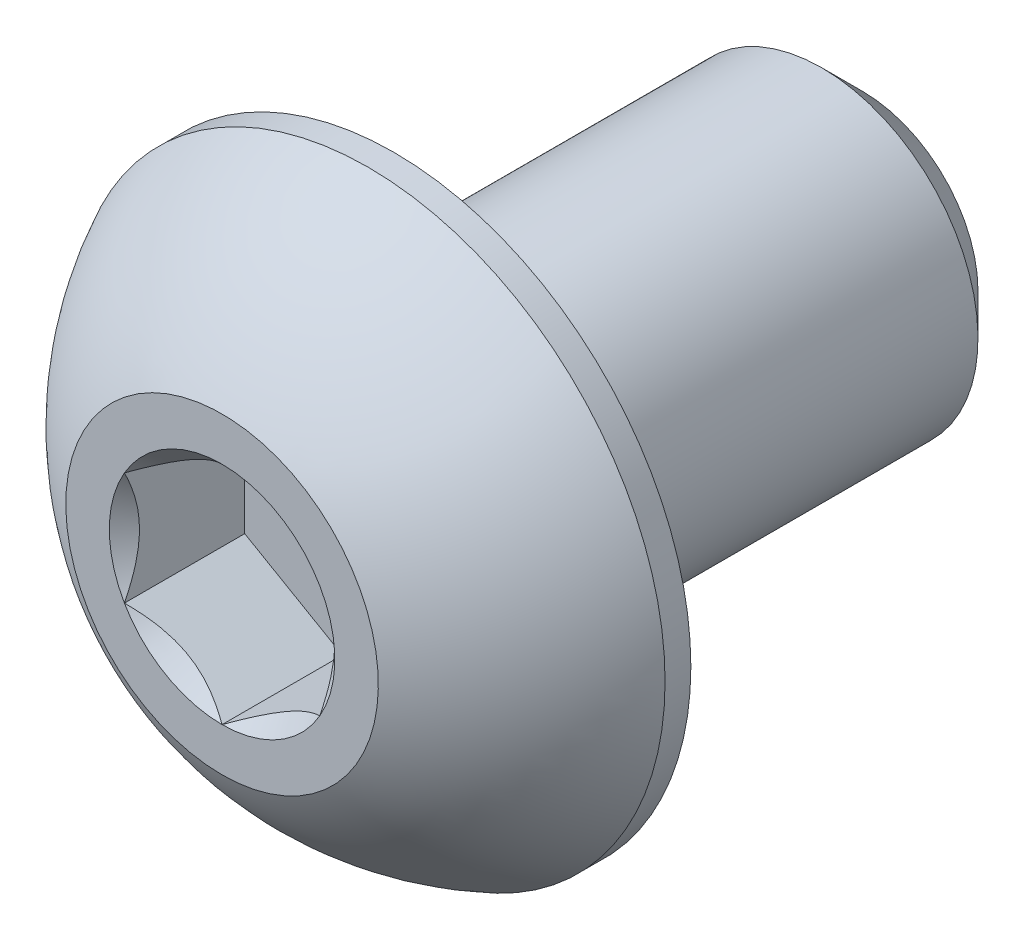
ISO-10303-21;
HEADER;
FILE_DESCRIPTION(('STEP AP214'),'2;1');
FILE_NAME('part.step','',(''),(''),'','','');
FILE_SCHEMA(('AUTOMOTIVE_DESIGN { 1 0 10303 214 1 1 1 1 }'));
ENDSEC;
DATA;
#1=APPLICATION_CONTEXT('core data for automotive mechanical design processes');
#2=APPLICATION_PROTOCOL_DEFINITION('international standard','automotive_design',2000,#1);
#3=PRODUCT_CONTEXT('',#1,'mechanical');
#4=PRODUCT('Part','Part','',(#3));
#5=PRODUCT_RELATED_PRODUCT_CATEGORY('part','',(#4));
#6=PRODUCT_DEFINITION_FORMATION('','',#4);
#7=PRODUCT_DEFINITION_CONTEXT('part definition',#1,'design');
#8=PRODUCT_DEFINITION('design','',#6,#7);
#9=PRODUCT_DEFINITION_SHAPE('','',#8);
#10=(LENGTH_UNIT() NAMED_UNIT(*) SI_UNIT(.MILLI.,.METRE.));
#11=(NAMED_UNIT(*) PLANE_ANGLE_UNIT() SI_UNIT($,.RADIAN.));
#12=(NAMED_UNIT(*) SI_UNIT($,.STERADIAN.) SOLID_ANGLE_UNIT());
#13=UNCERTAINTY_MEASURE_WITH_UNIT(LENGTH_MEASURE(1.E-05),#10,'distance_accuracy_value','');
#14=(GEOMETRIC_REPRESENTATION_CONTEXT(3) GLOBAL_UNCERTAINTY_ASSIGNED_CONTEXT((#13)) GLOBAL_UNIT_ASSIGNED_CONTEXT((#10,
#11,#12)) REPRESENTATION_CONTEXT('',''));
#15=CARTESIAN_POINT('',(0.,0.,0.));
#16=DIRECTION('',(0.,0.,1.));
#17=DIRECTION('',(1.,0.,0.));
#18=AXIS2_PLACEMENT_3D('',#15,#16,#17);
#19=CARTESIAN_POINT('',(0.,-2.00000000000001,-8.2));
#20=DIRECTION('',(0.,0.,-1.));
#21=DIRECTION('',(0.,1.,0.));
#22=AXIS2_PLACEMENT_3D('',#19,#20,#21);
#23=PLANE('',#22);
#24=CARTESIAN_POINT('',(0.,0.,-8.2));
#25=DIRECTION('',(0.,0.,-1.));
#26=DIRECTION('',(0.,1.,0.));
#27=AXIS2_PLACEMENT_3D('',#24,#25,#26);
#28=CIRCLE('',#27,1.475);
#29=CARTESIAN_POINT('',(0.,1.475,-8.2));
#30=VERTEX_POINT('',#29);
#31=EDGE_CURVE('E174',#30,#30,#28,.T.);
#32=ORIENTED_EDGE('',*,*,#31,.T.);
#33=EDGE_LOOP('',(#32));
#34=FACE_BOUND('',#33,.T.);
#35=ADVANCED_FACE('F35',(#34),#23,.T.);
#36=CARTESIAN_POINT('',(0.,0.,-8.2));
#37=DIRECTION('',(0.,0.,-1.));
#38=DIRECTION('',(0.,1.,0.));
#39=AXIS2_PLACEMENT_3D('',#36,#37,#38);
#40=CYLINDRICAL_SURFACE('',#39,2.);
#41=CARTESIAN_POINT('',(0.,0.,-7.675));
#42=DIRECTION('',(0.,0.,-1.));
#43=DIRECTION('',(0.,1.,0.));
#44=AXIS2_PLACEMENT_3D('',#41,#42,#43);
#45=CIRCLE('',#44,2.);
#46=CARTESIAN_POINT('',(0.,2.,-7.675));
#47=VERTEX_POINT('',#46);
#48=EDGE_CURVE('E48',#47,#47,#45,.F.);
#49=ORIENTED_EDGE('',*,*,#48,.T.);
#50=EDGE_LOOP('',(#49));
#51=FACE_BOUND('',#50,.T.);
#52=CARTESIAN_POINT('',(0.,0.,-2.2));
#53=DIRECTION('',(0.,0.,1.));
#54=DIRECTION('',(1.,0.,0.));
#55=AXIS2_PLACEMENT_3D('',#52,#53,#54);
#56=CIRCLE('',#55,2.);
#57=CARTESIAN_POINT('',(2.,0.,-2.2));
#58=VERTEX_POINT('',#57);
#59=EDGE_CURVE('E171',#58,#58,#56,.F.);
#60=ORIENTED_EDGE('',*,*,#59,.T.);
#61=EDGE_LOOP('',(#60));
#62=FACE_BOUND('',#61,.T.);
#63=ADVANCED_FACE('F179',(#51,#62),#40,.T.);
#64=CARTESIAN_POINT('',(0.,0.,-8.2));
#65=DIRECTION('',(0.,0.,1.));
#66=DIRECTION('',(0.,-1.,0.));
#67=AXIS2_PLACEMENT_3D('',#64,#65,#66);
#68=CONICAL_SURFACE('',#67,1.47500000000001,0.785398163397446);
#69=ORIENTED_EDGE('',*,*,#48,.F.);
#70=EDGE_LOOP('',(#69));
#71=FACE_BOUND('',#70,.T.);
#72=ORIENTED_EDGE('',*,*,#31,.F.);
#73=EDGE_LOOP('',(#72));
#74=FACE_BOUND('',#73,.T.);
#75=ADVANCED_FACE('F37',(#71,#74),#68,.T.);
#76=CARTESIAN_POINT('',(0.,0.,-3.72644385026738));
#77=DIRECTION('',(0.,0.,1.));
#78=DIRECTION('',(0.,-1.,0.));
#79=AXIS2_PLACEMENT_3D('',#76,#77,#78);
#80=SPHERICAL_SURFACE('',#79,4.22922968981298);
#81=CARTESIAN_POINT('',(0.,0.,0.));
#82=DIRECTION('',(0.,0.,1.));
#83=DIRECTION('',(1.,0.,0.));
#84=AXIS2_PLACEMENT_3D('',#81,#82,#83);
#85=CIRCLE('',#84,2.);
#86=CARTESIAN_POINT('',(0.,-2.,0.));
#87=VERTEX_POINT('',#86);
#88=EDGE_CURVE('E168',#87,#87,#85,.T.);
#89=CARTESIAN_POINT('',(0.,0.,-1.87));
#90=DIRECTION('',(0.,0.,1.));
#91=DIRECTION('',(1.,0.,0.));
#92=AXIS2_PLACEMENT_3D('',#89,#90,#91);
#93=CIRCLE('',#92,3.8);
#94=CARTESIAN_POINT('',(0.,-3.8,-1.87));
#95=VERTEX_POINT('',#94);
#96=EDGE_CURVE('E162',#95,#95,#93,.T.);
#97=CARTESIAN_POINT('',(0.,-2.,0.));
#98=CARTESIAN_POINT('',(0.,-2.02421343985614,-0.0129954259644873));
#99=CARTESIAN_POINT('',(0.,-2.04830018323974,-0.0262269129651302));
#100=CARTESIAN_POINT('',(0.,-2.09621120342126,-0.0531568415057495));
#101=CARTESIAN_POINT('',(0.,-2.12003548021917,-0.066855283045726));
#102=CARTESIAN_POINT('',(0.,-2.16741249358867,-0.0947139531320321));
#103=CARTESIAN_POINT('',(0.,-2.19096523016026,-0.108874181678362));
#104=CARTESIAN_POINT('',(0.,-2.23779021933683,-0.137651035235957));
#105=CARTESIAN_POINT('',(0.,-2.26106247194181,-0.152267660247222));
#106=CARTESIAN_POINT('',(0.,-2.30731764886072,-0.181951755514141));
#107=CARTESIAN_POINT('',(0.,-2.33030057317465,-0.197019225769796));
#108=CARTESIAN_POINT('',(0.,-2.37596836104235,-0.227599285582871));
#109=CARTESIAN_POINT('',(0.,-2.39865322459612,-0.243111875140292));
#110=CARTESIAN_POINT('',(0.,-2.44371627121513,-0.274576279395883));
#111=CARTESIAN_POINT('',(0.,-2.46609445428038,-0.290528094094053));
#112=CARTESIAN_POINT('',(0.,-2.51053563686181,-0.322864887331672));
#113=CARTESIAN_POINT('',(0.,-2.53259863637801,-0.339249865871121));
#114=CARTESIAN_POINT('',(0.,-2.57640106852492,-0.372446760967231));
#115=CARTESIAN_POINT('',(0.,-2.59814050115564,-0.389258677523893));
#116=CARTESIAN_POINT('',(0.,-2.64128753915154,-0.423303060588148));
#117=CARTESIAN_POINT('',(0.,-2.66269514451671,-0.440535527095743));
#118=CARTESIAN_POINT('',(0.,-2.70517039368395,-0.475414462202967));
#119=CARTESIAN_POINT('',(0.,-2.72623803748602,-0.493060930802598));
#120=CARTESIAN_POINT('',(0.,-2.76802535840619,-0.528761164924409));
#121=CARTESIAN_POINT('',(0.,-2.78874503552428,-0.54681493044659));
#122=CARTESIAN_POINT('',(0.,-2.82982855017313,-0.583322898482807));
#123=CARTESIAN_POINT('',(0.,-2.85019238770389,-0.601777100996844));
#124=CARTESIAN_POINT('',(0.,-2.89055648548394,-0.639078930931023));
#125=CARTESIAN_POINT('',(0.,-2.91055674573324,-0.657926558351166));
#126=CARTESIAN_POINT('',(0.,-2.95018608940553,-0.696008076521266));
#127=CARTESIAN_POINT('',(0.,-2.96981517282852,-0.715241967271224));
#128=CARTESIAN_POINT('',(0.,-3.00869470434027,-0.754088703755294));
#129=CARTESIAN_POINT('',(0.,-3.02794515242903,-0.773701549489406));
#130=CARTESIAN_POINT('',(0.,-3.06606009863533,-0.813298743603726));
#131=CARTESIAN_POINT('',(0.,-3.08492459675287,-0.833283091983934));
#132=CARTESIAN_POINT('',(0.,-3.12226047503003,-0.873615697891678));
#133=CARTESIAN_POINT('',(0.,-3.14073185518965,-0.893963955419212));
#134=CARTESIAN_POINT('',(0.,-3.17727447893821,-0.935016647847443));
#135=CARTESIAN_POINT('',(0.,-3.19534572252716,-0.955721082748139));
#136=CARTESIAN_POINT('',(0.,-3.23108120656242,-0.997478262810989));
#137=CARTESIAN_POINT('',(0.,-3.24874544700875,-1.01853100797314));
#138=CARTESIAN_POINT('',(0.,-3.28366021283673,-1.06097680909897));
#139=CARTESIAN_POINT('',(0.,-3.30091073821839,-1.08236986506264));
#140=CARTESIAN_POINT('',(0.,-3.33499151919534,-1.12548815902283));
#141=CARTESIAN_POINT('',(0.,-3.35182177479064,-1.14721339701936));
#142=CARTESIAN_POINT('',(0.,-3.38505562116371,-1.1909878000568));
#143=CARTESIAN_POINT('',(0.,-3.40145921194149,-1.21303696509771));
#144=CARTESIAN_POINT('',(0.,-3.43383349577047,-1.25745084415152));
#145=CARTESIAN_POINT('',(0.,-3.44980418882166,-1.27981555816441));
#146=CARTESIAN_POINT('',(0.,-3.48130660877275,-1.32485203719233));
#147=CARTESIAN_POINT('',(0.,-3.49683833567264,-1.34752380220736));
#148=CARTESIAN_POINT('',(0.,-3.52745692170931,-1.39316576858967));
#149=CARTESIAN_POINT('',(0.,-3.5425437808461,-1.41613596995694));
#150=CARTESIAN_POINT('',(0.,-3.57226689871518,-1.46236608103065));
#151=CARTESIAN_POINT('',(0.,-3.58690315744748,-1.48562599073709));
#152=CARTESIAN_POINT('',(0.,-3.61571951333199,-1.5324266802666));
#153=CARTESIAN_POINT('',(0.,-3.62989961048422,-1.55596746008967));
#154=CARTESIAN_POINT('',(0.,-3.65779825442823,-1.6033209453859));
#155=CARTESIAN_POINT('',(0.,-3.67151680122002,-1.62713365085906));
#156=CARTESIAN_POINT('',(0.,-3.69848713452321,-1.67502193787766));
#157=CARTESIAN_POINT('',(0.,-3.71173892103461,-1.6990975194231));
#158=CARTESIAN_POINT('',(0.,-3.73777068821038,-1.74750241579215));
#159=CARTESIAN_POINT('',(0.,-3.75055066887474,-1.77183173061575));
#160=CARTESIAN_POINT('',(0.,-3.77563400658953,-1.82073482944519));
#161=CARTESIAN_POINT('',(0.,-3.78793736363997,-1.84530861345103));
#162=CARTESIAN_POINT('',(0.,-3.8,-1.87));
#163=B_SPLINE_CURVE_WITH_KNOTS('',3,(#97,#98,#99,#100,#101,#102,#103,#104,#105,#106,#107,#108,
#109,#110,#111,#112,#113,#114,#115,#116,#117,#118,#119,#120,#121,#122,#123,#124,#125,#126,#127,
#128,#129,#130,#131,#132,#133,#134,#135,#136,#137,#138,#139,#140,#141,#142,#143,#144,#145,#146,
#147,#148,#149,#150,#151,#152,#153,#154,#155,#156,#157,#158,#159,#160,#161,#162),.UNSPECIFIED.,
.F.,.F.,(4,2,2,2,2,2,2,2,2,2,2,2,2,2,2,2,2,2,2,2,2,2,2,2,2,2,2,2,2,2,2,2,4),(0.,
0.082439858910264,0.164879717820529,0.247319576730793,0.329759435641058,0.412199294551322,
0.494639153461585,0.57707901237185,0.659518871282114,0.741958730192379,0.824398589102643,
0.906838448012907,0.989278306923171,1.07171816583344,1.1541580247437,1.23659788365396,
1.31903774256423,1.40147760147449,1.48391746038476,1.56635731929502,1.64879717820529,
1.73123703711555,1.81367689602581,1.89611675493608,1.97855661384634,2.06099647275661,
2.14343633166687,2.22587619057713,2.3083160494874,2.39075590839766,2.47319576730793,
2.55563562621819,2.63807548512846),.UNSPECIFIED.);
#164=EDGE_CURVE('BSEAM184',#87,#95,#163,.T.);
#165=ORIENTED_EDGE('',*,*,#88,.F.);
#166=ORIENTED_EDGE('',*,*,#96,.T.);
#167=ORIENTED_EDGE('',*,*,#164,.T.);
#168=ORIENTED_EDGE('',*,*,#164,.F.);
#169=EDGE_LOOP('',(#165,#167,#166,#168));
#170=FACE_BOUND('',#169,.T.);
#171=ADVANCED_FACE('F184',(#170),#80,.T.);
#172=CARTESIAN_POINT('',(0.,-2.,0.));
#173=DIRECTION('',(0.,0.,-1.));
#174=DIRECTION('',(-1.,0.,0.));
#175=AXIS2_PLACEMENT_3D('',#172,#173,#174);
#176=PLANE('',#175);
#177=CARTESIAN_POINT('',(0.,0.,0.));
#178=DIRECTION('',(0.,0.,1.));
#179=DIRECTION('',(1.,0.,0.));
#180=AXIS2_PLACEMENT_3D('',#177,#178,#179);
#181=CIRCLE('',#180,1.44337567297406);
#182=CARTESIAN_POINT('',(-1.25,0.721687836487032,0.));
#183=VERTEX_POINT('',#182);
#184=CARTESIAN_POINT('',(-1.25,-0.721687836487033,0.));
#185=VERTEX_POINT('',#184);
#186=EDGE_CURVE('E61',#183,#185,#181,.T.);
#187=ORIENTED_EDGE('',*,*,#186,.F.);
#188=CARTESIAN_POINT('',(0.,1.44337567297406,0.));
#189=VERTEX_POINT('',#188);
#190=EDGE_CURVE('E133',#189,#183,#181,.T.);
#191=ORIENTED_EDGE('',*,*,#190,.F.);
#192=CARTESIAN_POINT('',(1.25,0.721687836487033,0.));
#193=VERTEX_POINT('',#192);
#194=EDGE_CURVE('E130',#193,#189,#181,.T.);
#195=ORIENTED_EDGE('',*,*,#194,.F.);
#196=CARTESIAN_POINT('',(1.25,-0.721687836487033,0.));
#197=VERTEX_POINT('',#196);
#198=EDGE_CURVE('E101',#197,#193,#181,.T.);
#199=ORIENTED_EDGE('',*,*,#198,.F.);
#200=CARTESIAN_POINT('',(0.,-1.44337567297406,0.));
#201=VERTEX_POINT('',#200);
#202=EDGE_CURVE('E93',#201,#197,#181,.T.);
#203=ORIENTED_EDGE('',*,*,#202,.F.);
#204=EDGE_CURVE('E54',#185,#201,#181,.T.);
#205=ORIENTED_EDGE('',*,*,#204,.F.);
#206=EDGE_LOOP('',(#187,#191,#195,#199,#203,#205));
#207=FACE_BOUND('',#206,.T.);
#208=ORIENTED_EDGE('',*,*,#88,.T.);
#209=EDGE_LOOP('',(#208));
#210=FACE_BOUND('',#209,.T.);
#211=ADVANCED_FACE('F127',(#207,#210),#176,.F.);
#212=CARTESIAN_POINT('',(0.,-3.8,-2.2));
#213=DIRECTION('',(0.,0.,1.));
#214=DIRECTION('',(1.,0.,0.));
#215=AXIS2_PLACEMENT_3D('',#212,#213,#214);
#216=PLANE('',#215);
#217=ORIENTED_EDGE('',*,*,#59,.F.);
#218=EDGE_LOOP('',(#217));
#219=FACE_BOUND('',#218,.T.);
#220=CARTESIAN_POINT('',(0.,0.,-2.2));
#221=DIRECTION('',(0.,0.,1.));
#222=DIRECTION('',(1.,0.,0.));
#223=AXIS2_PLACEMENT_3D('',#220,#221,#222);
#224=CIRCLE('',#223,3.8);
#225=CARTESIAN_POINT('',(3.8,0.,-2.2));
#226=VERTEX_POINT('',#225);
#227=EDGE_CURVE('E165',#226,#226,#224,.T.);
#228=ORIENTED_EDGE('',*,*,#227,.F.);
#229=EDGE_LOOP('',(#228));
#230=FACE_BOUND('',#229,.T.);
#231=ADVANCED_FACE('F198',(#219,#230),#216,.F.);
#232=CARTESIAN_POINT('',(0.,0.,0.));
#233=DIRECTION('',(0.,0.,1.));
#234=DIRECTION('',(1.,0.,0.));
#235=AXIS2_PLACEMENT_3D('',#232,#233,#234);
#236=CYLINDRICAL_SURFACE('',#235,3.8);
#237=ORIENTED_EDGE('',*,*,#96,.F.);
#238=EDGE_LOOP('',(#237));
#239=FACE_BOUND('',#238,.T.);
#240=ORIENTED_EDGE('',*,*,#227,.T.);
#241=EDGE_LOOP('',(#240));
#242=FACE_BOUND('',#241,.T.);
#243=ADVANCED_FACE('F201',(#239,#242),#236,.T.);
#244=CARTESIAN_POINT('',(0.,0.,0.));
#245=DIRECTION('',(0.,0.,1.));
#246=DIRECTION('',(1.,0.,0.));
#247=AXIS2_PLACEMENT_3D('',#244,#245,#246);
#248=CONICAL_SURFACE('',#247,1.44337567297406,0.78539816339745);
#249=ORIENTED_EDGE('',*,*,#198,.T.);
#250=CARTESIAN_POINT('',(1.25,-1.43934010808077,0.462982096892326));
#251=CARTESIAN_POINT('',(1.25,-1.40429313005659,0.436524922632888));
#252=CARTESIAN_POINT('',(1.25,-1.36905087135599,0.410327160354278));
#253=CARTESIAN_POINT('',(1.25,-1.29809650706311,0.358557571839583));
#254=CARTESIAN_POINT('',(1.25,-1.26238428576495,0.332985904356292));
#255=CARTESIAN_POINT('',(1.25,-1.15390111792708,0.257005993689463));
#256=CARTESIAN_POINT('',(1.25,-1.08031646726264,0.207740286189565));
#257=CARTESIAN_POINT('',(1.25,-0.926012322755094,0.111025830263131));
#258=CARTESIAN_POINT('',(1.25,-0.845125318656146,0.0638412989417953));
#259=CARTESIAN_POINT('',(1.25,-0.679311174076601,-0.0224692656095874));
#260=CARTESIAN_POINT('',(1.25,-0.594398891026687,-0.0616224653731002));
#261=CARTESIAN_POINT('',(1.25,-0.46694481246074,-0.109522776311708));
#262=CARTESIAN_POINT('',(1.25,-0.426289985812821,-0.123270510213664));
#263=CARTESIAN_POINT('',(1.25,-0.343998850091267,-0.147502072549458));
#264=CARTESIAN_POINT('',(1.25,-0.302362473614962,-0.157985676130228));
#265=CARTESIAN_POINT('',(1.25,-0.219052696285665,-0.174969838251703));
#266=CARTESIAN_POINT('',(1.25,-0.177393428474499,-0.181538639528632));
#267=CARTESIAN_POINT('',(1.25,-0.0936293693401918,-0.190564946542241));
#268=CARTESIAN_POINT('',(1.25,-0.0515246558543956,-0.193023159002733));
#269=CARTESIAN_POINT('',(1.25,0.031189057630632,-0.193645937986716));
#270=CARTESIAN_POINT('',(1.25,0.0717969625499308,-0.191962883153754));
#271=CARTESIAN_POINT('',(1.25,0.152668636885198,-0.184731729402087));
#272=CARTESIAN_POINT('',(1.25,0.192932338835358,-0.179182889586893));
#273=CARTESIAN_POINT('',(1.25,0.273499879165296,-0.164428963535047));
#274=CARTESIAN_POINT('',(1.25,0.313792180618512,-0.155161824035895));
#275=CARTESIAN_POINT('',(1.25,0.393496413911458,-0.133463821542653));
#276=CARTESIAN_POINT('',(1.25,0.432908419115059,-0.121033223269356));
#277=CARTESIAN_POINT('',(1.25,0.556992735862298,-0.0772206470685631));
#278=CARTESIAN_POINT('',(1.25,0.639898924666086,-0.0408489271240444));
#279=CARTESIAN_POINT('',(1.25,0.801816555499702,0.0400191621783347));
#280=CARTESIAN_POINT('',(1.25,0.880812666325045,0.0845447209119858));
#281=CARTESIAN_POINT('',(1.25,1.0317856127975,0.176404876666625));
#282=CARTESIAN_POINT('',(1.25,1.10391618485086,0.223489933916249));
#283=CARTESIAN_POINT('',(1.25,1.21018606043311,0.296278561598538));
#284=CARTESIAN_POINT('',(1.25,1.24515069969379,0.320798085393358));
#285=CARTESIAN_POINT('',(1.25,1.31460220852737,0.37048563676568));
#286=CARTESIAN_POINT('',(1.25,1.34908920596618,0.39565348541552));
#287=CARTESIAN_POINT('',(1.25,1.38337731682912,0.421090148841213));
#288=B_SPLINE_CURVE_WITH_KNOTS('',3,(#250,#251,#252,#253,#254,#255,#256,#257,#258,#259,#260,
#261,#262,#263,#264,#265,#266,#267,#268,#269,#270,#271,#272,#273,#274,#275,#276,#277,#278,#279,
#280,#281,#282,#283,#284,#285,#286,#287),.UNSPECIFIED.,.F.,.F.,(4,2,2,2,2,2,2,2,2,2,2,2,2,2,2,2,
2,2,4),(0.,0.131732960381448,0.263498984161645,0.529042014455825,0.809741926134618,
1.08947609717225,1.21811634272576,1.346765447839,1.47310084517844,1.59941451973784,
1.72115042167849,1.84290966131735,1.96679153905341,2.09066305366039,2.36146692896009,
2.63325989198491,2.89154668212279,3.01965734507713,3.14773302245628),.UNSPECIFIED.);
#289=EDGE_CURVE('E11',#197,#193,#288,.T.);
#290=ORIENTED_EDGE('',*,*,#289,.F.);
#291=EDGE_LOOP('',(#249,#290));
#292=FACE_BOUND('',#291,.T.);
#293=ADVANCED_FACE('F105',(#292),#248,.F.);
#294=ORIENTED_EDGE('',*,*,#194,.T.);
#295=CARTESIAN_POINT('',(1.2502,0.721572366433195,0.000115483909135804));
#296=CARTESIAN_POINT('',(1.20722483292841,0.746384090710444,-0.0246783319448965));
#297=CARTESIAN_POINT('',(1.16353099525405,0.771610739653665,-0.0480162655813165));
#298=CARTESIAN_POINT('',(1.07443406915806,0.823050873919155,-0.0907479959154634));
#299=CARTESIAN_POINT('',(1.02902250164294,0.849269254648333,-0.110118007639586));
#300=CARTESIAN_POINT('',(0.93745217906474,0.902137405038636,-0.143299516586523));
#301=CARTESIAN_POINT('',(0.891316759824115,0.928773701756387,-0.157194440947344));
#302=CARTESIAN_POINT('',(0.798029919592408,0.982632884076013,-0.178602717839361));
#303=CARTESIAN_POINT('',(0.750881350863621,1.00985412292348,-0.186132058433213));
#304=CARTESIAN_POINT('',(0.669626443112748,1.05676666578643,-0.192925501949297));
#305=CARTESIAN_POINT('',(0.635625123372059,1.07639733689152,-0.19393144089565));
#306=CARTESIAN_POINT('',(0.567682235567523,1.11562418145499,-0.192238585088681));
#307=CARTESIAN_POINT('',(0.533740682344343,1.1352203463451,-0.189538972784462));
#308=CARTESIAN_POINT('',(0.466185143542501,1.1742235548576,-0.180591069683623));
#309=CARTESIAN_POINT('',(0.432571492713225,1.19363040521233,-0.174339474100295));
#310=CARTESIAN_POINT('',(0.365905361782187,1.23212011385119,-0.158624318586096));
#311=CARTESIAN_POINT('',(0.332853128969705,1.2512028293628,-0.149159379912542));
#312=CARTESIAN_POINT('',(0.248200308399736,1.30007715810653,-0.121068609312415));
#313=CARTESIAN_POINT('',(0.197133507570362,1.32956058931202,-0.1003298425478));
#314=CARTESIAN_POINT('',(0.096999145886745,1.38737318998519,-0.0536128653285241));
#315=CARTESIAN_POINT('',(0.0479256884217302,1.41570576386268,-0.0276517040532343));
#316=CARTESIAN_POINT('',(-0.000200000000000415,1.4434911430279,0.000115483909135606));
#317=B_SPLINE_CURVE_WITH_KNOTS('',3,(#295,#296,#297,#298,#299,#300,#301,#302,#303,#304,#305,
#306,#307,#308,#309,#310,#311,#312,#313,#314,#315,#316),.UNSPECIFIED.,.F.,.F.,(4,2,2,2,2,2,2,2,
2,2,4),(0.,0.166533409618303,0.334037607289761,0.498880396489697,0.663307919240274,
0.780963963458826,0.898645970148452,1.01643764860773,1.13427993171549,1.32148652032141,
1.50809158792574),.UNSPECIFIED.);
#318=EDGE_CURVE('E132',#193,#189,#317,.T.);
#319=ORIENTED_EDGE('',*,*,#318,.F.);
#320=EDGE_LOOP('',(#294,#319));
#321=FACE_BOUND('',#320,.T.);
#322=ADVANCED_FACE('F281',(#321),#248,.F.);
#323=ORIENTED_EDGE('',*,*,#190,.T.);
#324=CARTESIAN_POINT('',(0.000199999999999606,1.4434911430279,0.000115483909135892));
#325=CARTESIAN_POINT('',(-0.0427751670715871,1.41867941875065,-0.0246783319448964));
#326=CARTESIAN_POINT('',(-0.0864690047459484,1.39345276980743,-0.0480162655813165));
#327=CARTESIAN_POINT('',(-0.175565930841942,1.34201263554194,-0.0907479959154634));
#328=CARTESIAN_POINT('',(-0.220977498357064,1.31579425481276,-0.110118007639586));
#329=CARTESIAN_POINT('',(-0.31254782093526,1.26292610442246,-0.143299516586523));
#330=CARTESIAN_POINT('',(-0.358683240175886,1.23628980770471,-0.157194440947344));
#331=CARTESIAN_POINT('',(-0.451970080407593,1.18243062538508,-0.178602717839361));
#332=CARTESIAN_POINT('',(-0.49911864913638,1.15520938653761,-0.186132058433213));
#333=CARTESIAN_POINT('',(-0.580373556887252,1.10829684367467,-0.192925501949297));
#334=CARTESIAN_POINT('',(-0.614374876627941,1.08866617256958,-0.193931440895651));
#335=CARTESIAN_POINT('',(-0.682317764432477,1.04943932800611,-0.192238585088682));
#336=CARTESIAN_POINT('',(-0.716259317655658,1.02984316311599,-0.189538972784462));
#337=CARTESIAN_POINT('',(-0.7838148564575,0.990839954603499,-0.180591069683623));
#338=CARTESIAN_POINT('',(-0.817428507286775,0.971433104248771,-0.174339474100295));
#339=CARTESIAN_POINT('',(-0.884094638217813,0.932943395609905,-0.158624318586096));
#340=CARTESIAN_POINT('',(-0.917146871030295,0.9138606800983,-0.149159379912542));
#341=CARTESIAN_POINT('',(-1.00179969160026,0.864986351354568,-0.121068609312415));
#342=CARTESIAN_POINT('',(-1.05286649242964,0.835502920149076,-0.1003298425478));
#343=CARTESIAN_POINT('',(-1.15300085411325,0.777690319475908,-0.0536128653285243));
#344=CARTESIAN_POINT('',(-1.20207431157827,0.749357745598417,-0.0276517040532345));
#345=CARTESIAN_POINT('',(-1.2502,0.721572366433194,0.000115483909135271));
#346=B_SPLINE_CURVE_WITH_KNOTS('',3,(#324,#325,#326,#327,#328,#329,#330,#331,#332,#333,#334,
#335,#336,#337,#338,#339,#340,#341,#342,#343,#344,#345),.UNSPECIFIED.,.F.,.F.,(4,2,2,2,2,2,2,2,
2,2,4),(0.,0.166533409618304,0.334037607289762,0.498880396489698,0.663307919240274,
0.780963963458826,0.898645970148453,1.01643764860773,1.13427993171549,1.32148652032141,
1.50809158792573),.UNSPECIFIED.);
#347=EDGE_CURVE('E137',#189,#183,#346,.T.);
#348=ORIENTED_EDGE('',*,*,#347,.F.);
#349=EDGE_LOOP('',(#323,#348));
#350=FACE_BOUND('',#349,.T.);
#351=ADVANCED_FACE('F140',(#350),#248,.F.);
#352=ORIENTED_EDGE('',*,*,#186,.T.);
#353=CARTESIAN_POINT('',(-1.25,-1.43934010808077,0.462982096892326));
#354=CARTESIAN_POINT('',(-1.25,-1.40429313005659,0.436524922632889));
#355=CARTESIAN_POINT('',(-1.25,-1.36905087135599,0.410327160354279));
#356=CARTESIAN_POINT('',(-1.25,-1.29809650706311,0.358557571839584));
#357=CARTESIAN_POINT('',(-1.25,-1.26238428576495,0.332985904356293));
#358=CARTESIAN_POINT('',(-1.25,-1.15390111792708,0.257005993689463));
#359=CARTESIAN_POINT('',(-1.25,-1.08031646726264,0.207740286189566));
#360=CARTESIAN_POINT('',(-1.25,-0.926012322755095,0.111025830263131));
#361=CARTESIAN_POINT('',(-1.25,-0.845125318656146,0.0638412989417958));
#362=CARTESIAN_POINT('',(-1.25,-0.679311174076602,-0.0224692656095871));
#363=CARTESIAN_POINT('',(-1.25,-0.594398891026688,-0.0616224653731003));
#364=CARTESIAN_POINT('',(-1.25,-0.46694481246074,-0.109522776311708));
#365=CARTESIAN_POINT('',(-1.25,-0.426289985812822,-0.123270510213664));
#366=CARTESIAN_POINT('',(-1.25,-0.343998850091267,-0.147502072549458));
#367=CARTESIAN_POINT('',(-1.25,-0.302362473614962,-0.157985676130229));
#368=CARTESIAN_POINT('',(-1.25,-0.219052696285665,-0.174969838251704));
#369=CARTESIAN_POINT('',(-1.25,-0.1773934284745,-0.181538639528632));
#370=CARTESIAN_POINT('',(-1.25,-0.0936293693401921,-0.190564946542242));
#371=CARTESIAN_POINT('',(-1.25,-0.0515246558543959,-0.193023159002733));
#372=CARTESIAN_POINT('',(-1.25,0.0311890576306316,-0.193645937986716));
#373=CARTESIAN_POINT('',(-1.25,0.0717969625499304,-0.191962883153754));
#374=CARTESIAN_POINT('',(-1.25,0.152668636885197,-0.184731729402087));
#375=CARTESIAN_POINT('',(-1.25,0.192932338835358,-0.179182889586893));
#376=CARTESIAN_POINT('',(-1.25,0.273499879165295,-0.164428963535047));
#377=CARTESIAN_POINT('',(-1.25,0.313792180618511,-0.155161824035895));
#378=CARTESIAN_POINT('',(-1.25,0.393496413911457,-0.133463821542654));
#379=CARTESIAN_POINT('',(-1.25,0.432908419115059,-0.121033223269356));
#380=CARTESIAN_POINT('',(-1.25,0.556992735862298,-0.0772206470685637));
#381=CARTESIAN_POINT('',(-1.25,0.639898924666086,-0.040848927124045));
#382=CARTESIAN_POINT('',(-1.25,0.801816555499701,0.040019162178334));
#383=CARTESIAN_POINT('',(-1.25,0.880812666325044,0.084544720911985));
#384=CARTESIAN_POINT('',(-1.25,1.0317856127975,0.176404876666624));
#385=CARTESIAN_POINT('',(-1.25,1.10391618485086,0.223489933916248));
#386=CARTESIAN_POINT('',(-1.25,1.2101860604331,0.296278561598537));
#387=CARTESIAN_POINT('',(-1.25,1.24515069969379,0.320798085393357));
#388=CARTESIAN_POINT('',(-1.25,1.31460220852736,0.370485636765679));
#389=CARTESIAN_POINT('',(-1.25,1.34908920596618,0.395653485415519));
#390=CARTESIAN_POINT('',(-1.25,1.38337731682912,0.421090148841212));
#391=B_SPLINE_CURVE_WITH_KNOTS('',3,(#353,#354,#355,#356,#357,#358,#359,#360,#361,#362,#363,
#364,#365,#366,#367,#368,#369,#370,#371,#372,#373,#374,#375,#376,#377,#378,#379,#380,#381,#382,
#383,#384,#385,#386,#387,#388,#389,#390),.UNSPECIFIED.,.F.,.F.,(4,2,2,2,2,2,2,2,2,2,2,2,2,2,2,2,
2,2,4),(0.,0.131732960381448,0.263498984161645,0.529042014455826,0.809741926134619,
1.08947609717225,1.21811634272577,1.346765447839,1.47310084517844,1.59941451973784,
1.72115042167849,1.84290966131735,1.96679153905342,2.09066305366039,2.36146692896009,
2.63325989198491,2.89154668212279,3.01965734507713,3.14773302245628),.UNSPECIFIED.);
#392=EDGE_CURVE('E144',#183,#185,#391,.F.);
#393=ORIENTED_EDGE('',*,*,#392,.F.);
#394=EDGE_LOOP('',(#352,#393));
#395=FACE_BOUND('',#394,.T.);
#396=ADVANCED_FACE('F275',(#395),#248,.F.);
#397=ORIENTED_EDGE('',*,*,#204,.T.);
#398=CARTESIAN_POINT('',(-1.2502,-0.721572366433195,0.000115483909135371));
#399=CARTESIAN_POINT('',(-1.20722483292841,-0.746384090710444,-0.0246783319448969));
#400=CARTESIAN_POINT('',(-1.16353099525405,-0.771610739653665,-0.048016265581317));
#401=CARTESIAN_POINT('',(-1.07443406915806,-0.823050873919155,-0.0907479959154639));
#402=CARTESIAN_POINT('',(-1.02902250164294,-0.849269254648333,-0.110118007639587));
#403=CARTESIAN_POINT('',(-0.93745217906474,-0.902137405038636,-0.143299516586524));
#404=CARTESIAN_POINT('',(-0.891316759824114,-0.928773701756387,-0.157194440947345));
#405=CARTESIAN_POINT('',(-0.798029919592407,-0.982632884076013,-0.178602717839362));
#406=CARTESIAN_POINT('',(-0.75088135086362,-1.00985412292348,-0.186132058433213));
#407=CARTESIAN_POINT('',(-0.669626443112747,-1.05676666578643,-0.192925501949297));
#408=CARTESIAN_POINT('',(-0.635625123372059,-1.07639733689152,-0.193931440895651));
#409=CARTESIAN_POINT('',(-0.567682235567522,-1.11562418145499,-0.192238585088682));
#410=CARTESIAN_POINT('',(-0.533740682344342,-1.1352203463451,-0.189538972784462));
#411=CARTESIAN_POINT('',(-0.4661851435425,-1.1742235548576,-0.180591069683623));
#412=CARTESIAN_POINT('',(-0.432571492713225,-1.19363040521233,-0.174339474100294));
#413=CARTESIAN_POINT('',(-0.365905361782186,-1.23212011385119,-0.158624318586096));
#414=CARTESIAN_POINT('',(-0.332853128969704,-1.2512028293628,-0.149159379912542));
#415=CARTESIAN_POINT('',(-0.248200308399735,-1.30007715810653,-0.121068609312414));
#416=CARTESIAN_POINT('',(-0.197133507570361,-1.32956058931202,-0.1003298425478));
#417=CARTESIAN_POINT('',(-0.0969991458867449,-1.38737318998519,-0.0536128653285239));
#418=CARTESIAN_POINT('',(-0.0479256884217304,-1.41570576386268,-0.0276517040532341));
#419=CARTESIAN_POINT('',(0.00020000000000025,-1.4434911430279,0.000115483909135701));
#420=B_SPLINE_CURVE_WITH_KNOTS('',3,(#398,#399,#400,#401,#402,#403,#404,#405,#406,#407,#408,
#409,#410,#411,#412,#413,#414,#415,#416,#417,#418,#419),.UNSPECIFIED.,.F.,.F.,(4,2,2,2,2,2,2,2,
2,2,4),(0.,0.166533409618304,0.334037607289761,0.498880396489698,0.663307919240274,
0.780963963458827,0.898645970148453,1.01643764860773,1.13427993171549,1.32148652032141,
1.50809158792574),.UNSPECIFIED.);
#421=EDGE_CURVE('E117',#185,#201,#420,.T.);
#422=ORIENTED_EDGE('',*,*,#421,.F.);
#423=EDGE_LOOP('',(#397,#422));
#424=FACE_BOUND('',#423,.T.);
#425=ADVANCED_FACE('F226',(#424),#248,.F.);
#426=ORIENTED_EDGE('',*,*,#202,.T.);
#427=CARTESIAN_POINT('',(-0.000199999999999739,-1.4434911430279,0.000115483909135892));
#428=CARTESIAN_POINT('',(0.042775167071587,-1.41867941875065,-0.0246783319448965));
#429=CARTESIAN_POINT('',(0.0864690047459483,-1.39345276980743,-0.0480162655813166));
#430=CARTESIAN_POINT('',(0.175565930841942,-1.34201263554194,-0.0907479959154635));
#431=CARTESIAN_POINT('',(0.220977498357064,-1.31579425481276,-0.110118007639586));
#432=CARTESIAN_POINT('',(0.31254782093526,-1.26292610442246,-0.143299516586523));
#433=CARTESIAN_POINT('',(0.358683240175886,-1.23628980770471,-0.157194440947345));
#434=CARTESIAN_POINT('',(0.451970080407593,-1.18243062538508,-0.178602717839362));
#435=CARTESIAN_POINT('',(0.49911864913638,-1.15520938653761,-0.186132058433213));
#436=CARTESIAN_POINT('',(0.580373556887253,-1.10829684367467,-0.192925501949298));
#437=CARTESIAN_POINT('',(0.614374876627941,-1.08866617256958,-0.193931440895651));
#438=CARTESIAN_POINT('',(0.682317764432478,-1.04943932800611,-0.192238585088682));
#439=CARTESIAN_POINT('',(0.716259317655658,-1.02984316311599,-0.189538972784462));
#440=CARTESIAN_POINT('',(0.7838148564575,-0.990839954603499,-0.180591069683623));
#441=CARTESIAN_POINT('',(0.817428507286775,-0.971433104248771,-0.174339474100295));
#442=CARTESIAN_POINT('',(0.884094638217813,-0.932943395609905,-0.158624318586097));
#443=CARTESIAN_POINT('',(0.917146871030296,-0.9138606800983,-0.149159379912542));
#444=CARTESIAN_POINT('',(1.00179969160026,-0.864986351354567,-0.121068609312414));
#445=CARTESIAN_POINT('',(1.05286649242964,-0.835502920149075,-0.1003298425478));
#446=CARTESIAN_POINT('',(1.15300085411325,-0.777690319475908,-0.0536128653285242));
#447=CARTESIAN_POINT('',(1.20207431157827,-0.749357745598416,-0.0276517040532345));
#448=CARTESIAN_POINT('',(1.2502,-0.721572366433194,0.000115483909135469));
#449=B_SPLINE_CURVE_WITH_KNOTS('',3,(#427,#428,#429,#430,#431,#432,#433,#434,#435,#436,#437,
#438,#439,#440,#441,#442,#443,#444,#445,#446,#447,#448),.UNSPECIFIED.,.F.,.F.,(4,2,2,2,2,2,2,2,
2,2,4),(0.,0.166533409618304,0.334037607289762,0.498880396489698,0.663307919240275,
0.780963963458827,0.898645970148453,1.01643764860773,1.1342799317155,1.32148652032141,
1.50809158792574),.UNSPECIFIED.);
#450=EDGE_CURVE('E97',#201,#197,#449,.T.);
#451=ORIENTED_EDGE('',*,*,#450,.F.);
#452=EDGE_LOOP('',(#426,#451));
#453=FACE_BOUND('',#452,.T.);
#454=ADVANCED_FACE('F95',(#453),#248,.F.);
#455=CARTESIAN_POINT('',(1.25,-0.721687836487032,-1.54));
#456=DIRECTION('',(0.,0.,1.));
#457=DIRECTION('',(1.,0.,0.));
#458=AXIS2_PLACEMENT_3D('',#455,#456,#457);
#459=PLANE('',#458);
#460=DIRECTION('',(0.866025403784438,0.500000000000001,0.));
#461=VECTOR('',#460,1.);
#462=CARTESIAN_POINT('',(0.,-1.44337567297406,-1.54));
#463=LINE('',#462,#461);
#464=CARTESIAN_POINT('',(0.,-1.44337567297406,-1.54));
#465=VERTEX_POINT('',#464);
#466=CARTESIAN_POINT('',(1.25,-0.721687836487032,-1.54));
#467=VERTEX_POINT('',#466);
#468=EDGE_CURVE('E116',#465,#467,#463,.T.);
#469=ORIENTED_EDGE('',*,*,#468,.T.);
#470=DIRECTION('',(0.,1.,0.));
#471=VECTOR('',#470,1.);
#472=CARTESIAN_POINT('',(1.25,-0.721687836487032,-1.54));
#473=LINE('',#472,#471);
#474=CARTESIAN_POINT('',(1.25,0.721687836487033,-1.54));
#475=VERTEX_POINT('',#474);
#476=EDGE_CURVE('E121',#467,#475,#473,.T.);
#477=ORIENTED_EDGE('',*,*,#476,.T.);
#478=DIRECTION('',(-0.866025403784439,0.5,0.));
#479=VECTOR('',#478,1.);
#480=CARTESIAN_POINT('',(1.25,0.721687836487033,-1.54));
#481=LINE('',#480,#479);
#482=CARTESIAN_POINT('',(0.,1.44337567297406,-1.54));
#483=VERTEX_POINT('',#482);
#484=EDGE_CURVE('E265',#475,#483,#481,.T.);
#485=ORIENTED_EDGE('',*,*,#484,.T.);
#486=DIRECTION('',(-0.866025403784438,-0.5,0.));
#487=VECTOR('',#486,1.);
#488=CARTESIAN_POINT('',(0.,1.44337567297406,-1.54));
#489=LINE('',#488,#487);
#490=CARTESIAN_POINT('',(-1.25,0.721687836487032,-1.54));
#491=VERTEX_POINT('',#490);
#492=EDGE_CURVE('E153',#483,#491,#489,.T.);
#493=ORIENTED_EDGE('',*,*,#492,.T.);
#494=DIRECTION('',(0.,-1.,0.));
#495=VECTOR('',#494,1.);
#496=CARTESIAN_POINT('',(-1.25,0.721687836487032,-1.54));
#497=LINE('',#496,#495);
#498=CARTESIAN_POINT('',(-1.25,-0.721687836487032,-1.54));
#499=VERTEX_POINT('',#498);
#500=EDGE_CURVE('E269',#491,#499,#497,.T.);
#501=ORIENTED_EDGE('',*,*,#500,.T.);
#502=DIRECTION('',(0.866025403784439,-0.5,0.));
#503=VECTOR('',#502,1.);
#504=CARTESIAN_POINT('',(-1.25,-0.721687836487032,-1.54));
#505=LINE('',#504,#503);
#506=EDGE_CURVE('E124',#499,#465,#505,.T.);
#507=ORIENTED_EDGE('',*,*,#506,.T.);
#508=EDGE_LOOP('',(#469,#477,#485,#493,#501,#507));
#509=FACE_BOUND('',#508,.T.);
#510=ADVANCED_FACE('F225',(#509),#459,.T.);
#511=CARTESIAN_POINT('',(1.25,-0.721687836487032,-1.54));
#512=DIRECTION('',(1.,0.,0.));
#513=DIRECTION('',(0.,0.,-1.));
#514=AXIS2_PLACEMENT_3D('',#511,#512,#513);
#515=PLANE('',#514);
#516=DIRECTION('',(0.,0.,1.));
#517=VECTOR('',#516,1.);
#518=CARTESIAN_POINT('',(1.25,-0.721687836487032,-1.54));
#519=LINE('',#518,#517);
#520=EDGE_CURVE('E113',#467,#197,#519,.T.);
#521=ORIENTED_EDGE('',*,*,#520,.T.);
#522=ORIENTED_EDGE('',*,*,#289,.T.);
#523=DIRECTION('',(0.,0.,1.));
#524=VECTOR('',#523,1.);
#525=CARTESIAN_POINT('',(1.25,0.721687836487033,-1.54));
#526=LINE('',#525,#524);
#527=EDGE_CURVE('E123',#475,#193,#526,.T.);
#528=ORIENTED_EDGE('',*,*,#527,.F.);
#529=ORIENTED_EDGE('',*,*,#476,.F.);
#530=EDGE_LOOP('',(#521,#522,#528,#529));
#531=FACE_BOUND('',#530,.T.);
#532=ADVANCED_FACE('F119',(#531),#515,.F.);
#533=CARTESIAN_POINT('',(1.25,0.721687836487033,-1.54));
#534=DIRECTION('',(0.5,0.866025403784439,0.));
#535=DIRECTION('',(-0.866025403784439,0.5,0.));
#536=AXIS2_PLACEMENT_3D('',#533,#534,#535);
#537=PLANE('',#536);
#538=ORIENTED_EDGE('',*,*,#527,.T.);
#539=ORIENTED_EDGE('',*,*,#318,.T.);
#540=DIRECTION('',(0.,0.,1.));
#541=VECTOR('',#540,1.);
#542=CARTESIAN_POINT('',(0.,1.44337567297406,-1.54));
#543=LINE('',#542,#541);
#544=EDGE_CURVE('E149',#483,#189,#543,.T.);
#545=ORIENTED_EDGE('',*,*,#544,.F.);
#546=ORIENTED_EDGE('',*,*,#484,.F.);
#547=EDGE_LOOP('',(#538,#539,#545,#546));
#548=FACE_BOUND('',#547,.T.);
#549=ADVANCED_FACE('F147',(#548),#537,.F.);
#550=CARTESIAN_POINT('',(0.,1.44337567297406,-1.54));
#551=DIRECTION('',(-0.5,0.866025403784438,0.));
#552=DIRECTION('',(-0.866025403784439,-0.5,0.));
#553=AXIS2_PLACEMENT_3D('',#550,#551,#552);
#554=PLANE('',#553);
#555=ORIENTED_EDGE('',*,*,#544,.T.);
#556=ORIENTED_EDGE('',*,*,#347,.T.);
#557=DIRECTION('',(0.,0.,1.));
#558=VECTOR('',#557,1.);
#559=CARTESIAN_POINT('',(-1.25,0.721687836487032,-1.54));
#560=LINE('',#559,#558);
#561=EDGE_CURVE('E155',#491,#183,#560,.T.);
#562=ORIENTED_EDGE('',*,*,#561,.F.);
#563=ORIENTED_EDGE('',*,*,#492,.F.);
#564=EDGE_LOOP('',(#555,#556,#562,#563));
#565=FACE_BOUND('',#564,.T.);
#566=ADVANCED_FACE('F151',(#565),#554,.F.);
#567=CARTESIAN_POINT('',(-1.25,0.721687836487032,-1.54));
#568=DIRECTION('',(-1.,0.,0.));
#569=DIRECTION('',(0.,0.,1.));
#570=AXIS2_PLACEMENT_3D('',#567,#568,#569);
#571=PLANE('',#570);
#572=ORIENTED_EDGE('',*,*,#561,.T.);
#573=ORIENTED_EDGE('',*,*,#392,.T.);
#574=DIRECTION('',(0.,0.,1.));
#575=VECTOR('',#574,1.);
#576=CARTESIAN_POINT('',(-1.25,-0.721687836487032,-1.54));
#577=LINE('',#576,#575);
#578=EDGE_CURVE('E157',#499,#185,#577,.T.);
#579=ORIENTED_EDGE('',*,*,#578,.F.);
#580=ORIENTED_EDGE('',*,*,#500,.F.);
#581=EDGE_LOOP('',(#572,#573,#579,#580));
#582=FACE_BOUND('',#581,.T.);
#583=ADVANCED_FACE('F244',(#582),#571,.F.);
#584=CARTESIAN_POINT('',(-1.25,-0.721687836487032,-1.54));
#585=DIRECTION('',(-0.5,-0.866025403784439,0.));
#586=DIRECTION('',(0.866025403784439,-0.5,0.));
#587=AXIS2_PLACEMENT_3D('',#584,#585,#586);
#588=PLANE('',#587);
#589=ORIENTED_EDGE('',*,*,#578,.T.);
#590=ORIENTED_EDGE('',*,*,#421,.T.);
#591=DIRECTION('',(0.,0.,1.));
#592=VECTOR('',#591,1.);
#593=CARTESIAN_POINT('',(0.,-1.44337567297406,-1.54));
#594=LINE('',#593,#592);
#595=EDGE_CURVE('E115',#465,#201,#594,.T.);
#596=ORIENTED_EDGE('',*,*,#595,.F.);
#597=ORIENTED_EDGE('',*,*,#506,.F.);
#598=EDGE_LOOP('',(#589,#590,#596,#597));
#599=FACE_BOUND('',#598,.T.);
#600=ADVANCED_FACE('F208',(#599),#588,.F.);
#601=CARTESIAN_POINT('',(0.,-1.44337567297406,-1.54));
#602=DIRECTION('',(0.5,-0.866025403784438,0.));
#603=DIRECTION('',(0.866025403784438,0.5,0.));
#604=AXIS2_PLACEMENT_3D('',#601,#602,#603);
#605=PLANE('',#604);
#606=ORIENTED_EDGE('',*,*,#595,.T.);
#607=ORIENTED_EDGE('',*,*,#450,.T.);
#608=ORIENTED_EDGE('',*,*,#520,.F.);
#609=ORIENTED_EDGE('',*,*,#468,.F.);
#610=EDGE_LOOP('',(#606,#607,#608,#609));
#611=FACE_BOUND('',#610,.T.);
#612=ADVANCED_FACE('F111',(#611),#605,.F.);
#613=CLOSED_SHELL('',(#35,#63,#75,#171,#211,#231,#243,#293,#322,#351,#396,#425,#454,#510,#532,
#549,#566,#583,#600,#612));
#614=MANIFOLD_SOLID_BREP('B2',#613);
#615=ADVANCED_BREP_SHAPE_REPRESENTATION('',(#18,#614),#14);
#616=SHAPE_DEFINITION_REPRESENTATION(#9,#615);
ENDSEC;
END-ISO-10303-21;
